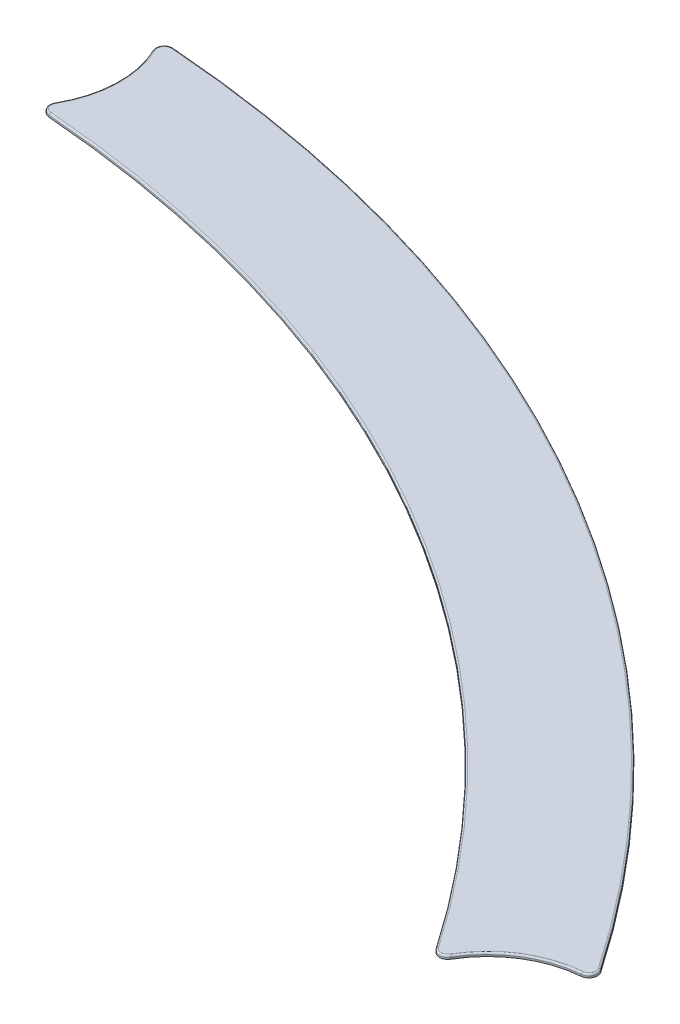
ISO-10303-21;
HEADER;
FILE_DESCRIPTION(('STEP AP214'),'2;1');
FILE_NAME('part.step','',(''),(''),'','','');
FILE_SCHEMA(('AUTOMOTIVE_DESIGN { 1 0 10303 214 1 1 1 1 }'));
ENDSEC;
DATA;
#1=APPLICATION_CONTEXT('core data for automotive mechanical design processes');
#2=APPLICATION_PROTOCOL_DEFINITION('international standard','automotive_design',2000,#1);
#3=PRODUCT_CONTEXT('',#1,'mechanical');
#4=PRODUCT('Part','Part','',(#3));
#5=PRODUCT_RELATED_PRODUCT_CATEGORY('part','',(#4));
#6=PRODUCT_DEFINITION_FORMATION('','',#4);
#7=PRODUCT_DEFINITION_CONTEXT('part definition',#1,'design');
#8=PRODUCT_DEFINITION('design','',#6,#7);
#9=PRODUCT_DEFINITION_SHAPE('','',#8);
#10=(LENGTH_UNIT() NAMED_UNIT(*) SI_UNIT(.MILLI.,.METRE.));
#11=(NAMED_UNIT(*) PLANE_ANGLE_UNIT() SI_UNIT($,.RADIAN.));
#12=(NAMED_UNIT(*) SI_UNIT($,.STERADIAN.) SOLID_ANGLE_UNIT());
#13=UNCERTAINTY_MEASURE_WITH_UNIT(LENGTH_MEASURE(1.E-05),#10,'distance_accuracy_value','');
#14=(GEOMETRIC_REPRESENTATION_CONTEXT(3) GLOBAL_UNCERTAINTY_ASSIGNED_CONTEXT((#13)) GLOBAL_UNIT_ASSIGNED_CONTEXT((#10,
#11,#12)) REPRESENTATION_CONTEXT('',''));
#15=CARTESIAN_POINT('',(0.,0.,0.));
#16=DIRECTION('',(0.,0.,1.));
#17=DIRECTION('',(1.,0.,0.));
#18=AXIS2_PLACEMENT_3D('',#15,#16,#17);
#19=CARTESIAN_POINT('',(0.,0.2,0.));
#20=DIRECTION('',(0.,-1.,0.));
#21=DIRECTION('',(0.,0.,-1.));
#22=AXIS2_PLACEMENT_3D('',#19,#20,#21);
#23=CYLINDRICAL_SURFACE('',#22,79.);
#24=DIRECTION('',(0.,-1.,0.));
#25=VECTOR('',#24,1.);
#26=CARTESIAN_POINT('',(5.91302670760867,0.2,-78.7783987851689));
#27=LINE('',#26,#25);
#28=CARTESIAN_POINT('',(5.91302670760867,0.,-78.7783987851689));
#29=VERTEX_POINT('',#28);
#30=CARTESIAN_POINT('',(5.91302670760867,0.1,-78.7783987851689));
#31=VERTEX_POINT('',#30);
#32=EDGE_CURVE('E159',#29,#31,#27,.F.);
#33=ORIENTED_EDGE('',*,*,#32,.T.);
#34=CARTESIAN_POINT('',(0.,0.1,0.));
#35=DIRECTION('',(0.,1.,0.));
#36=DIRECTION('',(0.,0.,1.));
#37=AXIS2_PLACEMENT_3D('',#34,#35,#36);
#38=CIRCLE('',#37,79.);
#39=CARTESIAN_POINT('',(65.2675812636132,0.1,-44.5100307346293));
#40=VERTEX_POINT('',#39);
#41=EDGE_CURVE('E187',#31,#40,#38,.F.);
#42=ORIENTED_EDGE('',*,*,#41,.T.);
#43=DIRECTION('',(0.,-1.,0.));
#44=VECTOR('',#43,1.);
#45=CARTESIAN_POINT('',(65.2675812636132,0.2,-44.5100307346293));
#46=LINE('',#45,#44);
#47=CARTESIAN_POINT('',(65.2675812636132,0.,-44.5100307346293));
#48=VERTEX_POINT('',#47);
#49=EDGE_CURVE('E157',#40,#48,#46,.T.);
#50=ORIENTED_EDGE('',*,*,#49,.T.);
#51=CARTESIAN_POINT('',(0.,0.,0.));
#52=DIRECTION('',(0.,1.,0.));
#53=DIRECTION('',(0.,0.,1.));
#54=AXIS2_PLACEMENT_3D('',#51,#52,#53);
#55=CIRCLE('',#54,79.);
#56=EDGE_CURVE('E147',#48,#29,#55,.T.);
#57=ORIENTED_EDGE('',*,*,#56,.T.);
#58=EDGE_LOOP('',(#33,#42,#50,#57));
#59=FACE_BOUND('',#58,.T.);
#60=ADVANCED_FACE('F30',(#59),#23,.T.);
#61=CARTESIAN_POINT('',(0.,0.2,-75.5));
#62=DIRECTION('',(0.,-1.,0.));
#63=DIRECTION('',(0.,0.,-1.));
#64=AXIS2_PLACEMENT_3D('',#61,#62,#63);
#65=CYLINDRICAL_SURFACE('',#64,6.00000000000001);
#66=DIRECTION('',(0.,-1.,0.));
#67=VECTOR('',#66,1.);
#68=CARTESIAN_POINT('',(5.21193790726219,0.2,-72.5275089149262));
#69=LINE('',#68,#67);
#70=CARTESIAN_POINT('',(5.21193790726219,0.,-72.5275089149262));
#71=VERTEX_POINT('',#70);
#72=CARTESIAN_POINT('',(5.21193790726219,0.1,-72.5275089149262));
#73=VERTEX_POINT('',#72);
#74=EDGE_CURVE('E131',#71,#73,#69,.F.);
#75=ORIENTED_EDGE('',*,*,#74,.T.);
#76=CARTESIAN_POINT('',(0.,0.1,-75.5));
#77=DIRECTION('',(0.,1.,0.));
#78=DIRECTION('',(0.,0.,1.));
#79=AXIS2_PLACEMENT_3D('',#76,#77,#78);
#80=CIRCLE('',#79,6.00000000000001);
#81=CARTESIAN_POINT('',(5.42363306579101,0.1,-78.0659704533877));
#82=VERTEX_POINT('',#81);
#83=EDGE_CURVE('E11',#73,#82,#80,.T.);
#84=ORIENTED_EDGE('',*,*,#83,.T.);
#85=DIRECTION('',(0.,-1.,0.));
#86=VECTOR('',#85,1.);
#87=CARTESIAN_POINT('',(5.42363306579101,0.2,-78.0659704533877));
#88=LINE('',#87,#86);
#89=CARTESIAN_POINT('',(5.42363306579101,0.,-78.0659704533877));
#90=VERTEX_POINT('',#89);
#91=EDGE_CURVE('E135',#82,#90,#88,.T.);
#92=ORIENTED_EDGE('',*,*,#91,.T.);
#93=CARTESIAN_POINT('',(0.,0.,-75.5));
#94=DIRECTION('',(0.,-1.,0.));
#95=DIRECTION('',(0.,0.,1.));
#96=AXIS2_PLACEMENT_3D('',#93,#94,#95);
#97=CIRCLE('',#96,6.00000000000001);
#98=EDGE_CURVE('E143',#90,#71,#97,.T.);
#99=ORIENTED_EDGE('',*,*,#98,.T.);
#100=EDGE_LOOP('',(#75,#84,#92,#99));
#101=FACE_BOUND('',#100,.T.);
#102=ADVANCED_FACE('F280',(#101),#65,.F.);
#103=CARTESIAN_POINT('',(0.,0.2,0.));
#104=DIRECTION('',(0.,-1.,0.));
#105=DIRECTION('',(0.,0.,-1.));
#106=AXIS2_PLACEMENT_3D('',#103,#104,#105);
#107=CYLINDRICAL_SURFACE('',#106,72.);
#108=DIRECTION('',(0.,-1.,0.));
#109=VECTOR('',#108,1.);
#110=CARTESIAN_POINT('',(59.3607834316917,0.2,-40.7467469913342));
#111=LINE('',#110,#109);
#112=CARTESIAN_POINT('',(59.3607834316917,0.,-40.7467469913342));
#113=VERTEX_POINT('',#112);
#114=CARTESIAN_POINT('',(59.3607834316917,0.1,-40.7467469913342));
#115=VERTEX_POINT('',#114);
#116=EDGE_CURVE('E127',#113,#115,#111,.F.);
#117=ORIENTED_EDGE('',*,*,#116,.T.);
#118=CARTESIAN_POINT('',(0.,0.1,0.));
#119=DIRECTION('',(0.,1.,0.));
#120=DIRECTION('',(0.,0.,1.));
#121=AXIS2_PLACEMENT_3D('',#118,#119,#120);
#122=CIRCLE('',#121,72.);
#123=CARTESIAN_POINT('',(5.60732630022696,0.1,-71.7813199360585));
#124=VERTEX_POINT('',#123);
#125=EDGE_CURVE('E54',#115,#124,#122,.T.);
#126=ORIENTED_EDGE('',*,*,#125,.T.);
#127=DIRECTION('',(0.,-1.,0.));
#128=VECTOR('',#127,1.);
#129=CARTESIAN_POINT('',(5.60732630022696,0.2,-71.7813199360585));
#130=LINE('',#129,#128);
#131=CARTESIAN_POINT('',(5.60732630022696,0.,-71.7813199360585));
#132=VERTEX_POINT('',#131);
#133=EDGE_CURVE('E119',#124,#132,#130,.T.);
#134=ORIENTED_EDGE('',*,*,#133,.T.);
#135=CARTESIAN_POINT('',(0.,0.,0.));
#136=DIRECTION('',(0.,-1.,0.));
#137=DIRECTION('',(0.,0.,1.));
#138=AXIS2_PLACEMENT_3D('',#135,#136,#137);
#139=CIRCLE('',#138,72.);
#140=EDGE_CURVE('E123',#132,#113,#139,.T.);
#141=ORIENTED_EDGE('',*,*,#140,.T.);
#142=EDGE_LOOP('',(#117,#126,#134,#141));
#143=FACE_BOUND('',#142,.T.);
#144=ADVANCED_FACE('F121',(#143),#107,.F.);
#145=CARTESIAN_POINT('',(65.3849179857252,0.2,-37.7499999999998));
#146=DIRECTION('',(0.,-1.,0.));
#147=DIRECTION('',(0.,0.,-1.));
#148=AXIS2_PLACEMENT_3D('',#145,#146,#147);
#149=CYLINDRICAL_SURFACE('',#148,6.);
#150=DIRECTION('',(0.,-1.,0.));
#151=VECTOR('',#150,1.);
#152=CARTESIAN_POINT('',(64.8952970508237,0.2,-43.729989242474));
#153=LINE('',#152,#151);
#154=CARTESIAN_POINT('',(64.8952970508237,0.,-43.729989242474));
#155=VERTEX_POINT('',#154);
#156=CARTESIAN_POINT('',(64.8952970508237,0.1,-43.729989242474));
#157=VERTEX_POINT('',#156);
#158=EDGE_CURVE('E162',#155,#157,#153,.F.);
#159=ORIENTED_EDGE('',*,*,#158,.T.);
#160=CARTESIAN_POINT('',(65.3849179857252,0.1,-37.7499999999998));
#161=DIRECTION('',(0.,1.,0.));
#162=DIRECTION('',(0.,0.,1.));
#163=AXIS2_PLACEMENT_3D('',#160,#161,#162);
#164=CIRCLE('',#163,6.);
#165=CARTESIAN_POINT('',(60.2046962398974,0.1,-40.7774250880991));
#166=VERTEX_POINT('',#165);
#167=EDGE_CURVE('E191',#157,#166,#164,.T.);
#168=ORIENTED_EDGE('',*,*,#167,.T.);
#169=DIRECTION('',(0.,-1.,0.));
#170=VECTOR('',#169,1.);
#171=CARTESIAN_POINT('',(60.2046962398974,0.2,-40.7774250880991));
#172=LINE('',#171,#170);
#173=CARTESIAN_POINT('',(60.2046962398974,0.,-40.7774250880991));
#174=VERTEX_POINT('',#173);
#175=EDGE_CURVE('E165',#166,#174,#172,.T.);
#176=ORIENTED_EDGE('',*,*,#175,.T.);
#177=CARTESIAN_POINT('',(65.3849179857252,0.,-37.7499999999998));
#178=DIRECTION('',(0.,-1.,0.));
#179=DIRECTION('',(0.,0.,1.));
#180=AXIS2_PLACEMENT_3D('',#177,#178,#179);
#181=CIRCLE('',#180,6.);
#182=EDGE_CURVE('E142',#174,#155,#181,.T.);
#183=ORIENTED_EDGE('',*,*,#182,.T.);
#184=EDGE_LOOP('',(#159,#168,#176,#183));
#185=FACE_BOUND('',#184,.T.);
#186=ADVANCED_FACE('F262',(#185),#149,.F.);
#187=CARTESIAN_POINT('',(0.,0.2,-37.75));
#188=DIRECTION('',(0.,1.,0.));
#189=DIRECTION('',(0.,0.,1.));
#190=AXIS2_PLACEMENT_3D('',#187,#188,#189);
#191=PLANE('',#190);
#192=CARTESIAN_POINT('',(0.,0.2,0.));
#193=DIRECTION('',(0.,1.,0.));
#194=DIRECTION('',(0.,0.,1.));
#195=AXIS2_PLACEMENT_3D('',#192,#193,#194);
#196=CIRCLE('',#195,78.9);
#197=CARTESIAN_POINT('',(65.1849640721403,0.2,-44.4536889235728));
#198=VERTEX_POINT('',#197);
#199=CARTESIAN_POINT('',(5.90554186367499,0.2,-78.6786792930358));
#200=VERTEX_POINT('',#199);
#201=EDGE_CURVE('E179',#198,#200,#196,.T.);
#202=ORIENTED_EDGE('',*,*,#201,.T.);
#203=CARTESIAN_POINT('',(5.87560248794026,0.2,-78.2798013245033));
#204=DIRECTION('',(0.,1.,0.));
#205=DIRECTION('',(0.,0.,1.));
#206=AXIS2_PLACEMENT_3D('',#203,#204,#205);
#207=CIRCLE('',#206,0.4);
#208=CARTESIAN_POINT('',(5.51402695022086,0.2,-78.1087366276108));
#209=VERTEX_POINT('',#208);
#210=EDGE_CURVE('E181',#200,#209,#207,.T.);
#211=ORIENTED_EDGE('',*,*,#210,.T.);
#212=CARTESIAN_POINT('',(0.,0.2,-75.5));
#213=DIRECTION('',(0.,1.,0.));
#214=DIRECTION('',(0.,0.,1.));
#215=AXIS2_PLACEMENT_3D('',#212,#213,#214);
#216=CIRCLE('',#215,6.10000000000001);
#217=CARTESIAN_POINT('',(5.2988035390499,0.2,-72.4779673968416));
#218=VERTEX_POINT('',#217);
#219=EDGE_CURVE('E167',#209,#218,#216,.F.);
#220=ORIENTED_EDGE('',*,*,#219,.T.);
#221=CARTESIAN_POINT('',(5.64626606620076,0.2,-72.2798013245033));
#222=DIRECTION('',(0.,1.,0.));
#223=DIRECTION('',(0.,0.,1.));
#224=AXIS2_PLACEMENT_3D('',#221,#222,#223);
#225=CIRCLE('',#224,0.4);
#226=CARTESIAN_POINT('',(5.61511425342172,0.2,-71.8810162137474));
#227=VERTEX_POINT('',#226);
#228=EDGE_CURVE('E169',#218,#227,#225,.T.);
#229=ORIENTED_EDGE('',*,*,#228,.T.);
#230=CARTESIAN_POINT('',(0.,0.2,0.));
#231=DIRECTION('',(0.,1.,0.));
#232=DIRECTION('',(0.,0.,1.));
#233=AXIS2_PLACEMENT_3D('',#230,#231,#232);
#234=CIRCLE('',#233,72.1);
#235=CARTESIAN_POINT('',(59.4432289642357,0.2,-40.8033396954888));
#236=VERTEX_POINT('',#235);
#237=EDGE_CURVE('E171',#227,#236,#234,.F.);
#238=ORIENTED_EDGE('',*,*,#237,.T.);
#239=CARTESIAN_POINT('',(59.7730110944117,0.2,-41.0297105121073));
#240=DIRECTION('',(0.,1.,0.));
#241=DIRECTION('',(0.,0.,1.));
#242=AXIS2_PLACEMENT_3D('',#239,#240,#241);
#243=CIRCLE('',#242,0.4);
#244=CARTESIAN_POINT('',(60.1183592108002,0.2,-40.8278821729007));
#245=VERTEX_POINT('',#244);
#246=EDGE_CURVE('E173',#236,#245,#243,.T.);
#247=ORIENTED_EDGE('',*,*,#246,.T.);
#248=CARTESIAN_POINT('',(65.3849179857252,0.2,-37.7499999999998));
#249=DIRECTION('',(0.,1.,0.));
#250=DIRECTION('',(0.,0.,1.));
#251=AXIS2_PLACEMENT_3D('',#248,#249,#250);
#252=CIRCLE('',#251,6.1);
#253=CARTESIAN_POINT('',(64.8871367019087,0.2,-43.8296557298485));
#254=VERTEX_POINT('',#253);
#255=EDGE_CURVE('E175',#245,#254,#252,.F.);
#256=ORIENTED_EDGE('',*,*,#255,.T.);
#257=CARTESIAN_POINT('',(64.8544953062486,0.2,-44.2283216793468));
#258=DIRECTION('',(0.,1.,0.));
#259=DIRECTION('',(0.,0.,1.));
#260=AXIS2_PLACEMENT_3D('',#257,#258,#259);
#261=CIRCLE('',#260,0.4);
#262=EDGE_CURVE('E177',#254,#198,#261,.T.);
#263=ORIENTED_EDGE('',*,*,#262,.T.);
#264=EDGE_LOOP('',(#202,#211,#220,#229,#238,#247,#256,#263));
#265=FACE_BOUND('',#264,.T.);
#266=ADVANCED_FACE('F246',(#265),#191,.T.);
#267=CARTESIAN_POINT('',(0.,0.,-37.75));
#268=DIRECTION('',(0.,1.,0.));
#269=DIRECTION('',(0.,0.,1.));
#270=AXIS2_PLACEMENT_3D('',#267,#268,#269);
#271=PLANE('',#270);
#272=ORIENTED_EDGE('',*,*,#140,.F.);
#273=CARTESIAN_POINT('',(5.64626606620076,0.,-72.2798013245033));
#274=DIRECTION('',(0.,1.,0.));
#275=DIRECTION('',(0.,0.,1.));
#276=AXIS2_PLACEMENT_3D('',#273,#274,#275);
#277=CIRCLE('',#276,0.5);
#278=EDGE_CURVE('E129',#132,#71,#277,.F.);
#279=ORIENTED_EDGE('',*,*,#278,.T.);
#280=ORIENTED_EDGE('',*,*,#98,.F.);
#281=CARTESIAN_POINT('',(5.87560248794026,0.,-78.2798013245033));
#282=DIRECTION('',(0.,1.,0.));
#283=DIRECTION('',(0.,0.,1.));
#284=AXIS2_PLACEMENT_3D('',#281,#282,#283);
#285=CIRCLE('',#284,0.5);
#286=EDGE_CURVE('E136',#90,#29,#285,.F.);
#287=ORIENTED_EDGE('',*,*,#286,.T.);
#288=ORIENTED_EDGE('',*,*,#56,.F.);
#289=CARTESIAN_POINT('',(64.8544953062486,0.,-44.2283216793468));
#290=DIRECTION('',(0.,1.,0.));
#291=DIRECTION('',(0.,0.,1.));
#292=AXIS2_PLACEMENT_3D('',#289,#290,#291);
#293=CIRCLE('',#292,0.5);
#294=EDGE_CURVE('E126',#48,#155,#293,.F.);
#295=ORIENTED_EDGE('',*,*,#294,.T.);
#296=ORIENTED_EDGE('',*,*,#182,.F.);
#297=CARTESIAN_POINT('',(59.7730110944117,0.,-41.0297105121073));
#298=DIRECTION('',(0.,1.,0.));
#299=DIRECTION('',(0.,0.,1.));
#300=AXIS2_PLACEMENT_3D('',#297,#298,#299);
#301=CIRCLE('',#300,0.5);
#302=EDGE_CURVE('E141',#174,#113,#301,.F.);
#303=ORIENTED_EDGE('',*,*,#302,.T.);
#304=EDGE_LOOP('',(#272,#279,#280,#287,#288,#295,#296,#303));
#305=FACE_BOUND('',#304,.T.);
#306=ADVANCED_FACE('F138',(#305),#271,.F.);
#307=CARTESIAN_POINT('',(5.64626606620076,0.2,-72.2798013245033));
#308=DIRECTION('',(0.,-1.,0.));
#309=DIRECTION('',(0.,0.,-1.));
#310=AXIS2_PLACEMENT_3D('',#307,#308,#309);
#311=CYLINDRICAL_SURFACE('',#310,0.5);
#312=ORIENTED_EDGE('',*,*,#133,.F.);
#313=CARTESIAN_POINT('',(5.64626606620076,0.1,-72.2798013245033));
#314=DIRECTION('',(0.,1.,0.));
#315=DIRECTION('',(0.,0.,1.));
#316=AXIS2_PLACEMENT_3D('',#313,#314,#315);
#317=CIRCLE('',#316,0.5);
#318=EDGE_CURVE('E39',#124,#73,#317,.F.);
#319=ORIENTED_EDGE('',*,*,#318,.T.);
#320=ORIENTED_EDGE('',*,*,#74,.F.);
#321=ORIENTED_EDGE('',*,*,#278,.F.);
#322=EDGE_LOOP('',(#312,#319,#320,#321));
#323=FACE_BOUND('',#322,.T.);
#324=ADVANCED_FACE('F130',(#323),#311,.T.);
#325=CARTESIAN_POINT('',(5.87560248794026,0.2,-78.2798013245033));
#326=DIRECTION('',(0.,1.,0.));
#327=DIRECTION('',(0.,0.,1.));
#328=AXIS2_PLACEMENT_3D('',#325,#326,#327);
#329=CYLINDRICAL_SURFACE('',#328,0.5);
#330=ORIENTED_EDGE('',*,*,#91,.F.);
#331=CARTESIAN_POINT('',(5.87560248794026,0.1,-78.2798013245033));
#332=DIRECTION('',(0.,1.,0.));
#333=DIRECTION('',(0.,0.,1.));
#334=AXIS2_PLACEMENT_3D('',#331,#332,#333);
#335=CIRCLE('',#334,0.5);
#336=EDGE_CURVE('E184',#82,#31,#335,.F.);
#337=ORIENTED_EDGE('',*,*,#336,.T.);
#338=ORIENTED_EDGE('',*,*,#32,.F.);
#339=ORIENTED_EDGE('',*,*,#286,.F.);
#340=EDGE_LOOP('',(#330,#337,#338,#339));
#341=FACE_BOUND('',#340,.T.);
#342=ADVANCED_FACE('F231',(#341),#329,.T.);
#343=CARTESIAN_POINT('',(59.7730110944117,0.2,-41.0297105121073));
#344=DIRECTION('',(0.,-1.,0.));
#345=DIRECTION('',(0.,0.,-1.));
#346=AXIS2_PLACEMENT_3D('',#343,#344,#345);
#347=CYLINDRICAL_SURFACE('',#346,0.5);
#348=ORIENTED_EDGE('',*,*,#175,.F.);
#349=CARTESIAN_POINT('',(59.7730110944117,0.1,-41.0297105121073));
#350=DIRECTION('',(0.,1.,0.));
#351=DIRECTION('',(0.,0.,1.));
#352=AXIS2_PLACEMENT_3D('',#349,#350,#351);
#353=CIRCLE('',#352,0.5);
#354=EDGE_CURVE('E193',#166,#115,#353,.F.);
#355=ORIENTED_EDGE('',*,*,#354,.T.);
#356=ORIENTED_EDGE('',*,*,#116,.F.);
#357=ORIENTED_EDGE('',*,*,#302,.F.);
#358=EDGE_LOOP('',(#348,#355,#356,#357));
#359=FACE_BOUND('',#358,.T.);
#360=ADVANCED_FACE('F265',(#359),#347,.T.);
#361=CARTESIAN_POINT('',(64.8544953062486,0.2,-44.2283216793468));
#362=DIRECTION('',(0.,1.,0.));
#363=DIRECTION('',(0.,0.,1.));
#364=AXIS2_PLACEMENT_3D('',#361,#362,#363);
#365=CYLINDRICAL_SURFACE('',#364,0.5);
#366=ORIENTED_EDGE('',*,*,#49,.F.);
#367=CARTESIAN_POINT('',(64.8544953062486,0.1,-44.2283216793468));
#368=DIRECTION('',(0.,1.,0.));
#369=DIRECTION('',(0.,0.,1.));
#370=AXIS2_PLACEMENT_3D('',#367,#368,#369);
#371=CIRCLE('',#370,0.5);
#372=EDGE_CURVE('E189',#40,#157,#371,.F.);
#373=ORIENTED_EDGE('',*,*,#372,.T.);
#374=ORIENTED_EDGE('',*,*,#158,.F.);
#375=ORIENTED_EDGE('',*,*,#294,.F.);
#376=EDGE_LOOP('',(#366,#373,#374,#375));
#377=FACE_BOUND('',#376,.T.);
#378=ADVANCED_FACE('F254',(#377),#365,.T.);
#379=CARTESIAN_POINT('',(59.7730110944117,0.1,-41.0297105121073));
#380=DIRECTION('',(0.,1.,0.));
#381=DIRECTION('',(0.,0.,1.));
#382=AXIS2_PLACEMENT_3D('',#379,#380,#381);
#383=TOROIDAL_SURFACE('',#382,0.4,0.1);
#384=CARTESIAN_POINT('',(59.4432289642357,0.1,-40.8033396954888));
#385=DIRECTION('',(-0.565927041546313,0.,-0.824455325440159));
#386=DIRECTION('',(-0.824455325440159,0.,0.565927041546313));
#387=AXIS2_PLACEMENT_3D('',#384,#385,#386);
#388=CIRCLE('',#387,0.1);
#389=EDGE_CURVE('E212',#115,#236,#388,.T.);
#390=ORIENTED_EDGE('',*,*,#389,.F.);
#391=ORIENTED_EDGE('',*,*,#354,.F.);
#392=CARTESIAN_POINT('',(60.1183592108002,0.1,-40.8278821729007));
#393=DIRECTION('',(0.504570848016538,0.,-0.863370290971303));
#394=DIRECTION('',(-0.863370290971303,0.,-0.504570848016538));
#395=AXIS2_PLACEMENT_3D('',#392,#393,#394);
#396=CIRCLE('',#395,0.1);
#397=EDGE_CURVE('E34',#245,#166,#396,.T.);
#398=ORIENTED_EDGE('',*,*,#397,.F.);
#399=ORIENTED_EDGE('',*,*,#246,.F.);
#400=EDGE_LOOP('',(#390,#391,#398,#399));
#401=FACE_BOUND('',#400,.T.);
#402=ADVANCED_FACE('F32',(#401),#383,.T.);
#403=CARTESIAN_POINT('',(65.3849179857252,0.1,-37.7499999999998));
#404=DIRECTION('',(0.,1.,0.));
#405=DIRECTION('',(0.,0.,1.));
#406=AXIS2_PLACEMENT_3D('',#403,#404,#405);
#407=TOROIDAL_SURFACE('',#406,6.1,0.1);
#408=ORIENTED_EDGE('',*,*,#397,.T.);
#409=ORIENTED_EDGE('',*,*,#167,.F.);
#410=CARTESIAN_POINT('',(64.8871367019087,0.1,-43.8296557298485));
#411=DIRECTION('',(0.996664873745683,0.,-0.0816034891502883));
#412=DIRECTION('',(-0.0816034891502883,0.,-0.996664873745683));
#413=AXIS2_PLACEMENT_3D('',#410,#411,#412);
#414=CIRCLE('',#413,0.1);
#415=EDGE_CURVE('E210',#254,#157,#414,.T.);
#416=ORIENTED_EDGE('',*,*,#415,.F.);
#417=ORIENTED_EDGE('',*,*,#255,.F.);
#418=EDGE_LOOP('',(#408,#409,#416,#417));
#419=FACE_BOUND('',#418,.T.);
#420=ADVANCED_FACE('F259',(#419),#407,.T.);
#421=CARTESIAN_POINT('',(0.,0.1,0.));
#422=DIRECTION('',(0.,1.,0.));
#423=DIRECTION('',(0.,0.,1.));
#424=AXIS2_PLACEMENT_3D('',#421,#422,#423);
#425=TOROIDAL_SURFACE('',#424,72.1,0.1);
#426=ORIENTED_EDGE('',*,*,#389,.T.);
#427=ORIENTED_EDGE('',*,*,#237,.F.);
#428=CARTESIAN_POINT('',(5.61511425342172,0.1,-71.8810162137474));
#429=DIRECTION('',(-0.9969627768897,0.,-0.0778795319476002));
#430=DIRECTION('',(-0.0778795319476002,0.,0.996962776889701));
#431=AXIS2_PLACEMENT_3D('',#428,#429,#430);
#432=CIRCLE('',#431,0.1);
#433=EDGE_CURVE('E207',#124,#227,#432,.T.);
#434=ORIENTED_EDGE('',*,*,#433,.F.);
#435=ORIENTED_EDGE('',*,*,#125,.F.);
#436=EDGE_LOOP('',(#426,#427,#434,#435));
#437=FACE_BOUND('',#436,.T.);
#438=ADVANCED_FACE('F268',(#437),#425,.T.);
#439=CARTESIAN_POINT('',(64.8544953062486,0.1,-44.2283216793468));
#440=DIRECTION('',(0.,1.,0.));
#441=DIRECTION('',(0.,0.,1.));
#442=AXIS2_PLACEMENT_3D('',#439,#440,#441);
#443=TOROIDAL_SURFACE('',#442,0.4,0.1);
#444=ORIENTED_EDGE('',*,*,#415,.T.);
#445=ORIENTED_EDGE('',*,*,#372,.F.);
#446=CARTESIAN_POINT('',(65.1849640721403,0.1,-44.4536889235728));
#447=DIRECTION('',(-0.563418110564939,0.,-0.826171914729274));
#448=DIRECTION('',(-0.826171914729274,0.,0.563418110564939));
#449=AXIS2_PLACEMENT_3D('',#446,#447,#448);
#450=CIRCLE('',#449,0.1);
#451=EDGE_CURVE('E204',#198,#40,#450,.T.);
#452=ORIENTED_EDGE('',*,*,#451,.F.);
#453=ORIENTED_EDGE('',*,*,#262,.F.);
#454=EDGE_LOOP('',(#444,#445,#452,#453));
#455=FACE_BOUND('',#454,.T.);
#456=ADVANCED_FACE('F257',(#455),#443,.T.);
#457=CARTESIAN_POINT('',(5.64626606620076,0.1,-72.2798013245033));
#458=DIRECTION('',(0.,1.,0.));
#459=DIRECTION('',(0.,0.,1.));
#460=AXIS2_PLACEMENT_3D('',#457,#458,#459);
#461=TOROIDAL_SURFACE('',#460,0.4,0.1);
#462=ORIENTED_EDGE('',*,*,#433,.T.);
#463=ORIENTED_EDGE('',*,*,#228,.F.);
#464=CARTESIAN_POINT('',(5.29880353904995,0.1,-72.4779673968416));
#465=DIRECTION('',(0.495415180845621,0.,-0.868656317877042));
#466=DIRECTION('',(-0.868656317877042,0.,-0.495415180845622));
#467=AXIS2_PLACEMENT_3D('',#464,#465,#466);
#468=CIRCLE('',#467,0.1);
#469=EDGE_CURVE('E201',#73,#218,#468,.T.);
#470=ORIENTED_EDGE('',*,*,#469,.F.);
#471=ORIENTED_EDGE('',*,*,#318,.F.);
#472=EDGE_LOOP('',(#462,#463,#470,#471));
#473=FACE_BOUND('',#472,.T.);
#474=ADVANCED_FACE('F270',(#473),#461,.T.);
#475=CARTESIAN_POINT('',(0.,0.1,0.));
#476=DIRECTION('',(0.,1.,0.));
#477=DIRECTION('',(0.,0.,1.));
#478=AXIS2_PLACEMENT_3D('',#475,#476,#477);
#479=TOROIDAL_SURFACE('',#478,78.9,0.1);
#480=ORIENTED_EDGE('',*,*,#451,.T.);
#481=ORIENTED_EDGE('',*,*,#41,.F.);
#482=CARTESIAN_POINT('',(5.90554186367499,0.1,-78.6786792930358));
#483=DIRECTION('',(-0.997194921331252,0.,-0.0748484393368202));
#484=DIRECTION('',(-0.0748484393368202,0.,0.997194921331252));
#485=AXIS2_PLACEMENT_3D('',#482,#483,#484);
#486=CIRCLE('',#485,0.1);
#487=EDGE_CURVE('E199',#200,#31,#486,.T.);
#488=ORIENTED_EDGE('',*,*,#487,.F.);
#489=ORIENTED_EDGE('',*,*,#201,.F.);
#490=EDGE_LOOP('',(#480,#481,#488,#489));
#491=FACE_BOUND('',#490,.T.);
#492=ADVANCED_FACE('F251',(#491),#479,.T.);
#493=CARTESIAN_POINT('',(0.,0.1,-75.5));
#494=DIRECTION('',(0.,1.,0.));
#495=DIRECTION('',(0.,0.,1.));
#496=AXIS2_PLACEMENT_3D('',#493,#494,#495);
#497=TOROIDAL_SURFACE('',#496,6.10000000000001,0.1);
#498=ORIENTED_EDGE('',*,*,#469,.T.);
#499=ORIENTED_EDGE('',*,*,#219,.F.);
#500=CARTESIAN_POINT('',(5.51402695022086,0.1,-78.1087366276108));
#501=DIRECTION('',(-0.427661742231228,0.,-0.903938844298524));
#502=DIRECTION('',(-0.903938844298524,0.,0.427661742231228));
#503=AXIS2_PLACEMENT_3D('',#500,#501,#502);
#504=CIRCLE('',#503,0.1);
#505=EDGE_CURVE('E197',#82,#209,#504,.T.);
#506=ORIENTED_EDGE('',*,*,#505,.F.);
#507=ORIENTED_EDGE('',*,*,#83,.F.);
#508=EDGE_LOOP('',(#498,#499,#506,#507));
#509=FACE_BOUND('',#508,.T.);
#510=ADVANCED_FACE('F242',(#509),#497,.T.);
#511=CARTESIAN_POINT('',(5.87560248794026,0.1,-78.2798013245033));
#512=DIRECTION('',(0.,1.,0.));
#513=DIRECTION('',(0.,0.,1.));
#514=AXIS2_PLACEMENT_3D('',#511,#512,#513);
#515=TOROIDAL_SURFACE('',#514,0.4,0.1);
#516=ORIENTED_EDGE('',*,*,#487,.T.);
#517=ORIENTED_EDGE('',*,*,#336,.F.);
#518=ORIENTED_EDGE('',*,*,#505,.T.);
#519=ORIENTED_EDGE('',*,*,#210,.F.);
#520=EDGE_LOOP('',(#516,#517,#518,#519));
#521=FACE_BOUND('',#520,.T.);
#522=ADVANCED_FACE('F235',(#521),#515,.T.);
#523=CLOSED_SHELL('',(#60,#102,#144,#186,#266,#306,#324,#342,#360,#378,#402,#420,#438,#456,#474,
#492,#510,#522));
#524=MANIFOLD_SOLID_BREP('B2',#523);
#525=ADVANCED_BREP_SHAPE_REPRESENTATION('',(#18,#524),#14);
#526=SHAPE_DEFINITION_REPRESENTATION(#9,#525);
ENDSEC;
END-ISO-10303-21;
